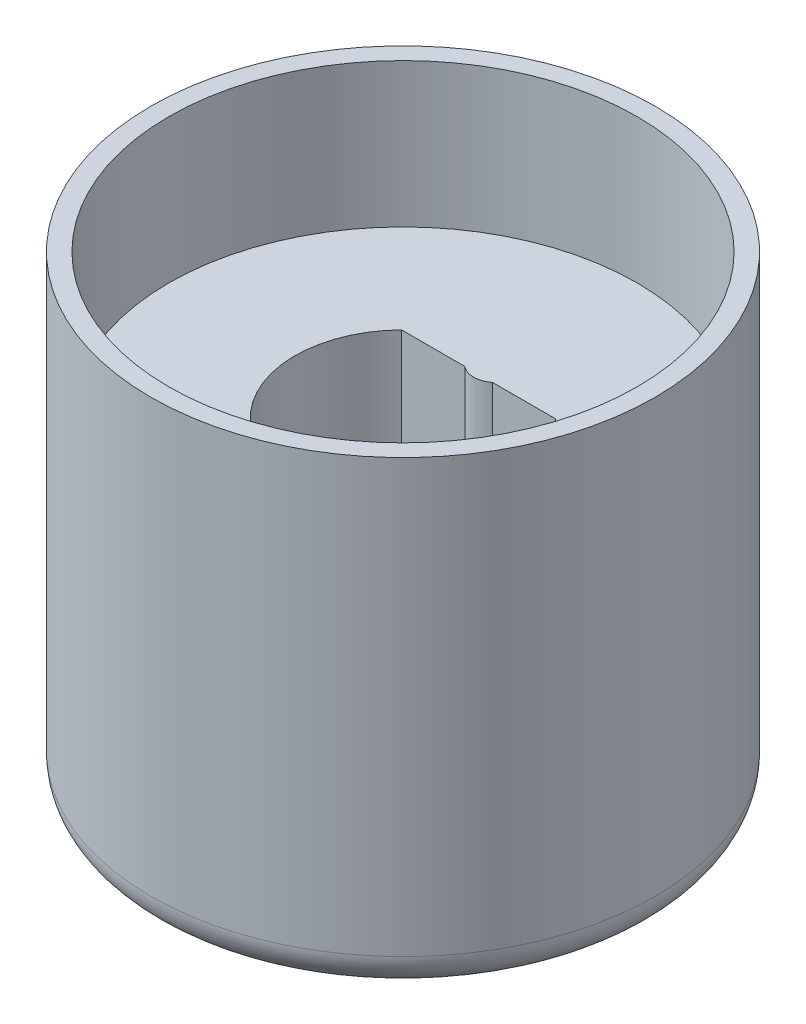
ISO-10303-21;
HEADER;
FILE_DESCRIPTION(('STEP AP214'),'2;1');
FILE_NAME('part.step','',(''),(''),'','','');
FILE_SCHEMA(('AUTOMOTIVE_DESIGN { 1 0 10303 214 1 1 1 1 }'));
ENDSEC;
DATA;
#1=APPLICATION_CONTEXT('core data for automotive mechanical design processes');
#2=APPLICATION_PROTOCOL_DEFINITION('international standard','automotive_design',2000,#1);
#3=PRODUCT_CONTEXT('',#1,'mechanical');
#4=PRODUCT('Part','Part','',(#3));
#5=PRODUCT_RELATED_PRODUCT_CATEGORY('part','',(#4));
#6=PRODUCT_DEFINITION_FORMATION('','',#4);
#7=PRODUCT_DEFINITION_CONTEXT('part definition',#1,'design');
#8=PRODUCT_DEFINITION('design','',#6,#7);
#9=PRODUCT_DEFINITION_SHAPE('','',#8);
#10=(LENGTH_UNIT() NAMED_UNIT(*) SI_UNIT(.MILLI.,.METRE.));
#11=(NAMED_UNIT(*) PLANE_ANGLE_UNIT() SI_UNIT($,.RADIAN.));
#12=(NAMED_UNIT(*) SI_UNIT($,.STERADIAN.) SOLID_ANGLE_UNIT());
#13=UNCERTAINTY_MEASURE_WITH_UNIT(LENGTH_MEASURE(1.E-05),#10,'distance_accuracy_value','');
#14=(GEOMETRIC_REPRESENTATION_CONTEXT(3) GLOBAL_UNCERTAINTY_ASSIGNED_CONTEXT((#13)) GLOBAL_UNIT_ASSIGNED_CONTEXT((#10,
#11,#12)) REPRESENTATION_CONTEXT('',''));
#15=CARTESIAN_POINT('',(0.,0.,0.));
#16=DIRECTION('',(0.,0.,1.));
#17=DIRECTION('',(1.,0.,0.));
#18=AXIS2_PLACEMENT_3D('',#15,#16,#17);
#19=CARTESIAN_POINT('',(0.,-1.,0.));
#20=DIRECTION('',(0.,-1.,0.));
#21=DIRECTION('',(0.,0.,-1.));
#22=AXIS2_PLACEMENT_3D('',#19,#20,#21);
#23=PLANE('',#22);
#24=CARTESIAN_POINT('',(0.,-1.,0.));
#25=DIRECTION('',(0.,-1.,0.));
#26=DIRECTION('',(0.,0.,1.));
#27=AXIS2_PLACEMENT_3D('',#24,#25,#26);
#28=CIRCLE('',#27,6.);
#29=CARTESIAN_POINT('',(0.,-1.,6.));
#30=VERTEX_POINT('',#29);
#31=EDGE_CURVE('E11',#30,#30,#28,.T.);
#32=ORIENTED_EDGE('',*,*,#31,.T.);
#33=EDGE_LOOP('',(#32));
#34=FACE_BOUND('',#33,.T.);
#35=ADVANCED_FACE('F17',(#34),#23,.T.);
#36=CARTESIAN_POINT('',(0.,0.,0.));
#37=DIRECTION('',(0.,-1.,0.));
#38=DIRECTION('',(0.,0.,1.));
#39=AXIS2_PLACEMENT_3D('',#36,#37,#38);
#40=TOROIDAL_SURFACE('',#39,6.,1.);
#41=CARTESIAN_POINT('',(0.,0.,0.));
#42=DIRECTION('',(0.,-1.,0.));
#43=DIRECTION('',(0.,0.,1.));
#44=AXIS2_PLACEMENT_3D('',#41,#42,#43);
#45=CIRCLE('',#44,7.);
#46=CARTESIAN_POINT('',(0.,0.,7.));
#47=VERTEX_POINT('',#46);
#48=EDGE_CURVE('E26',#47,#47,#45,.T.);
#49=ORIENTED_EDGE('',*,*,#48,.T.);
#50=EDGE_LOOP('',(#49));
#51=FACE_BOUND('',#50,.T.);
#52=ORIENTED_EDGE('',*,*,#31,.F.);
#53=EDGE_LOOP('',(#52));
#54=FACE_BOUND('',#53,.T.);
#55=ADVANCED_FACE('F19',(#51,#54),#40,.T.);
#56=CARTESIAN_POINT('',(0.,10.,0.));
#57=DIRECTION('',(0.,-1.,0.));
#58=DIRECTION('',(0.,0.,1.));
#59=AXIS2_PLACEMENT_3D('',#56,#57,#58);
#60=CYLINDRICAL_SURFACE('',#59,7.);
#61=CARTESIAN_POINT('',(0.,12.,0.));
#62=DIRECTION('',(0.,-1.,0.));
#63=DIRECTION('',(0.,0.,1.));
#64=AXIS2_PLACEMENT_3D('',#61,#62,#63);
#65=CIRCLE('',#64,7.);
#66=CARTESIAN_POINT('',(0.,12.,7.));
#67=VERTEX_POINT('',#66);
#68=EDGE_CURVE('E117',#67,#67,#65,.T.);
#69=ORIENTED_EDGE('',*,*,#68,.T.);
#70=EDGE_LOOP('',(#69));
#71=FACE_BOUND('',#70,.T.);
#72=ORIENTED_EDGE('',*,*,#48,.F.);
#73=EDGE_LOOP('',(#72));
#74=FACE_BOUND('',#73,.T.);
#75=ADVANCED_FACE('F143',(#71,#74),#60,.T.);
#76=CARTESIAN_POINT('',(-1.40086989389111E-13,1.45299799796709,0.));
#77=DIRECTION('',(0.,-1.,0.));
#78=DIRECTION('',(-1.,0.,0.));
#79=AXIS2_PLACEMENT_3D('',#76,#77,#78);
#80=PLANE('',#79);
#81=CARTESIAN_POINT('',(0.,1.45299799796709,0.));
#82=DIRECTION('',(0.,1.,0.));
#83=DIRECTION('',(-0.714142842854284,0.,-0.7));
#84=AXIS2_PLACEMENT_3D('',#81,#82,#83);
#85=CIRCLE('',#84,3.);
#86=CARTESIAN_POINT('',(-2.14242852856285,1.45299799796709,-2.1));
#87=VERTEX_POINT('',#86);
#88=CARTESIAN_POINT('',(2.14242852856285,1.45299799796709,-2.1));
#89=VERTEX_POINT('',#88);
#90=EDGE_CURVE('E93',#87,#89,#85,.T.);
#91=ORIENTED_EDGE('',*,*,#90,.T.);
#92=DIRECTION('',(-1.,0.,0.));
#93=VECTOR('',#92,1.);
#94=CARTESIAN_POINT('',(2.14242852856286,1.45299799796708,-2.1));
#95=LINE('',#94,#93);
#96=CARTESIAN_POINT('',(0.385264119871125,1.45299799796709,-2.1));
#97=VERTEX_POINT('',#96);
#98=EDGE_CURVE('E38',#89,#97,#95,.T.);
#99=ORIENTED_EDGE('',*,*,#98,.T.);
#100=CARTESIAN_POINT('',(0.,1.45299799796709,-2.57795522810966));
#101=DIRECTION('',(0.,-1.,0.));
#102=DIRECTION('',(0.627571173698928,0.,0.778559196170818));
#103=AXIS2_PLACEMENT_3D('',#100,#101,#102);
#104=CIRCLE('',#103,0.613897094094305);
#105=CARTESIAN_POINT('',(-0.385264119871124,1.45299799796709,-2.1));
#106=VERTEX_POINT('',#105);
#107=EDGE_CURVE('E125',#97,#106,#104,.T.);
#108=ORIENTED_EDGE('',*,*,#107,.T.);
#109=DIRECTION('',(-1.,0.,0.));
#110=VECTOR('',#109,1.);
#111=CARTESIAN_POINT('',(-0.385264119871124,1.45299799796709,-2.1));
#112=LINE('',#111,#110);
#113=EDGE_CURVE('E86',#106,#87,#112,.T.);
#114=ORIENTED_EDGE('',*,*,#113,.T.);
#115=EDGE_LOOP('',(#91,#99,#108,#114));
#116=FACE_BOUND('',#115,.T.);
#117=ADVANCED_FACE('F145',(#116),#80,.F.);
#118=CARTESIAN_POINT('',(0.,12.,0.));
#119=DIRECTION('',(0.,-1.,0.));
#120=DIRECTION('',(0.,0.,-1.));
#121=AXIS2_PLACEMENT_3D('',#118,#119,#120);
#122=PLANE('',#121);
#123=CARTESIAN_POINT('',(0.,12.,0.));
#124=DIRECTION('',(0.,-1.,0.));
#125=DIRECTION('',(-1.,0.,0.));
#126=AXIS2_PLACEMENT_3D('',#123,#124,#125);
#127=CIRCLE('',#126,6.5);
#128=CARTESIAN_POINT('',(-6.5,12.,0.));
#129=VERTEX_POINT('',#128);
#130=EDGE_CURVE('E100',#129,#129,#127,.T.);
#131=ORIENTED_EDGE('',*,*,#130,.T.);
#132=EDGE_LOOP('',(#131));
#133=FACE_BOUND('',#132,.T.);
#134=ORIENTED_EDGE('',*,*,#68,.F.);
#135=EDGE_LOOP('',(#134));
#136=FACE_BOUND('',#135,.T.);
#137=ADVANCED_FACE('F152',(#133,#136),#122,.F.);
#138=CARTESIAN_POINT('',(0.,8.,0.));
#139=DIRECTION('',(0.,1.,0.));
#140=DIRECTION('',(0.,0.,-1.));
#141=AXIS2_PLACEMENT_3D('',#138,#139,#140);
#142=PLANE('',#141);
#143=DIRECTION('',(-1.,0.,0.));
#144=VECTOR('',#143,1.);
#145=CARTESIAN_POINT('',(0.385264119871125,8.,-2.1));
#146=LINE('',#145,#144);
#147=CARTESIAN_POINT('',(2.14242852856285,8.,-2.1));
#148=VERTEX_POINT('',#147);
#149=CARTESIAN_POINT('',(0.385264119871125,8.,-2.1));
#150=VERTEX_POINT('',#149);
#151=EDGE_CURVE('E47',#148,#150,#146,.T.);
#152=ORIENTED_EDGE('',*,*,#151,.F.);
#153=CARTESIAN_POINT('',(0.,8.,0.));
#154=DIRECTION('',(0.,1.,0.));
#155=DIRECTION('',(-0.714142842854284,0.,-0.7));
#156=AXIS2_PLACEMENT_3D('',#153,#154,#155);
#157=CIRCLE('',#156,3.);
#158=CARTESIAN_POINT('',(-2.14242852856285,8.,-2.1));
#159=VERTEX_POINT('',#158);
#160=EDGE_CURVE('E92',#159,#148,#157,.T.);
#161=ORIENTED_EDGE('',*,*,#160,.F.);
#162=DIRECTION('',(-1.,0.,0.));
#163=VECTOR('',#162,1.);
#164=CARTESIAN_POINT('',(-2.14242852856286,8.,-2.1));
#165=LINE('',#164,#163);
#166=CARTESIAN_POINT('',(-0.385264119871124,8.,-2.1));
#167=VERTEX_POINT('',#166);
#168=EDGE_CURVE('E74',#167,#159,#165,.T.);
#169=ORIENTED_EDGE('',*,*,#168,.F.);
#170=CARTESIAN_POINT('',(0.,8.,-2.57795522810966));
#171=DIRECTION('',(0.,-1.,0.));
#172=DIRECTION('',(0.627571173698928,0.,0.778559196170818));
#173=AXIS2_PLACEMENT_3D('',#170,#171,#172);
#174=CIRCLE('',#173,0.613897094094305);
#175=EDGE_CURVE('E122',#150,#167,#174,.T.);
#176=ORIENTED_EDGE('',*,*,#175,.F.);
#177=EDGE_LOOP('',(#152,#161,#169,#176));
#178=FACE_BOUND('',#177,.T.);
#179=CARTESIAN_POINT('',(0.,8.,0.));
#180=DIRECTION('',(0.,1.,0.));
#181=DIRECTION('',(-1.,0.,0.));
#182=AXIS2_PLACEMENT_3D('',#179,#180,#181);
#183=CIRCLE('',#182,6.5);
#184=CARTESIAN_POINT('',(-6.5,8.,0.));
#185=VERTEX_POINT('',#184);
#186=EDGE_CURVE('E109',#185,#185,#183,.T.);
#187=ORIENTED_EDGE('',*,*,#186,.T.);
#188=EDGE_LOOP('',(#187));
#189=FACE_BOUND('',#188,.T.);
#190=ADVANCED_FACE('F96',(#178,#189),#142,.T.);
#191=CARTESIAN_POINT('',(2.14242852856286,0.,-2.1));
#192=DIRECTION('',(0.,0.,-1.));
#193=DIRECTION('',(-1.,0.,0.));
#194=AXIS2_PLACEMENT_3D('',#191,#192,#193);
#195=PLANE('',#194);
#196=ORIENTED_EDGE('',*,*,#151,.T.);
#197=DIRECTION('',(0.,1.,0.));
#198=VECTOR('',#197,1.);
#199=CARTESIAN_POINT('',(0.385264119871125,1.45299799796709,-2.1));
#200=LINE('',#199,#198);
#201=EDGE_CURVE('E128',#97,#150,#200,.T.);
#202=ORIENTED_EDGE('',*,*,#201,.F.);
#203=ORIENTED_EDGE('',*,*,#98,.F.);
#204=DIRECTION('',(0.,1.,0.));
#205=VECTOR('',#204,1.);
#206=CARTESIAN_POINT('',(2.14242852856285,1.45299799796709,-2.1));
#207=LINE('',#206,#205);
#208=EDGE_CURVE('E99',#89,#148,#207,.T.);
#209=ORIENTED_EDGE('',*,*,#208,.T.);
#210=EDGE_LOOP('',(#196,#202,#203,#209));
#211=FACE_BOUND('',#210,.T.);
#212=ADVANCED_FACE('F173',(#211),#195,.F.);
#213=CARTESIAN_POINT('',(0.,0.,-2.57795522810966));
#214=DIRECTION('',(0.,-1.,0.));
#215=DIRECTION('',(0.627571173698928,0.,0.778559196170818));
#216=AXIS2_PLACEMENT_3D('',#213,#214,#215);
#217=CYLINDRICAL_SURFACE('',#216,0.613897094094305);
#218=ORIENTED_EDGE('',*,*,#175,.T.);
#219=DIRECTION('',(0.,1.,0.));
#220=VECTOR('',#219,1.);
#221=CARTESIAN_POINT('',(-0.385264119871124,1.45299799796709,-2.1));
#222=LINE('',#221,#220);
#223=EDGE_CURVE('E81',#106,#167,#222,.T.);
#224=ORIENTED_EDGE('',*,*,#223,.F.);
#225=ORIENTED_EDGE('',*,*,#107,.F.);
#226=ORIENTED_EDGE('',*,*,#201,.T.);
#227=EDGE_LOOP('',(#218,#224,#225,#226));
#228=FACE_BOUND('',#227,.T.);
#229=ADVANCED_FACE('F172',(#228),#217,.T.);
#230=CARTESIAN_POINT('',(-0.385264119871124,0.,-2.1));
#231=DIRECTION('',(0.,0.,-1.));
#232=DIRECTION('',(-1.,0.,0.));
#233=AXIS2_PLACEMENT_3D('',#230,#231,#232);
#234=PLANE('',#233);
#235=ORIENTED_EDGE('',*,*,#168,.T.);
#236=DIRECTION('',(0.,1.,0.));
#237=VECTOR('',#236,1.);
#238=CARTESIAN_POINT('',(-2.14242852856285,1.45299799796709,-2.1));
#239=LINE('',#238,#237);
#240=EDGE_CURVE('E78',#87,#159,#239,.T.);
#241=ORIENTED_EDGE('',*,*,#240,.F.);
#242=ORIENTED_EDGE('',*,*,#113,.F.);
#243=ORIENTED_EDGE('',*,*,#223,.T.);
#244=EDGE_LOOP('',(#235,#241,#242,#243));
#245=FACE_BOUND('',#244,.T.);
#246=ADVANCED_FACE('F76',(#245),#234,.F.);
#247=CARTESIAN_POINT('',(0.,0.,0.));
#248=DIRECTION('',(0.,1.,0.));
#249=DIRECTION('',(-0.714142842854284,0.,-0.7));
#250=AXIS2_PLACEMENT_3D('',#247,#248,#249);
#251=CYLINDRICAL_SURFACE('',#250,3.);
#252=ORIENTED_EDGE('',*,*,#160,.T.);
#253=ORIENTED_EDGE('',*,*,#208,.F.);
#254=ORIENTED_EDGE('',*,*,#90,.F.);
#255=ORIENTED_EDGE('',*,*,#240,.T.);
#256=EDGE_LOOP('',(#252,#253,#254,#255));
#257=FACE_BOUND('',#256,.T.);
#258=ADVANCED_FACE('F90',(#257),#251,.F.);
#259=CARTESIAN_POINT('',(0.,8.5,0.));
#260=DIRECTION('',(0.,1.,0.));
#261=DIRECTION('',(-1.,0.,0.));
#262=AXIS2_PLACEMENT_3D('',#259,#260,#261);
#263=CYLINDRICAL_SURFACE('',#262,6.5);
#264=ORIENTED_EDGE('',*,*,#130,.F.);
#265=EDGE_LOOP('',(#264));
#266=FACE_BOUND('',#265,.T.);
#267=ORIENTED_EDGE('',*,*,#186,.F.);
#268=EDGE_LOOP('',(#267));
#269=FACE_BOUND('',#268,.T.);
#270=ADVANCED_FACE('F164',(#266,#269),#263,.F.);
#271=CLOSED_SHELL('',(#35,#55,#75,#117,#137,#190,#212,#229,#246,#258,#270));
#272=MANIFOLD_SOLID_BREP('B1',#271);
#273=ADVANCED_BREP_SHAPE_REPRESENTATION('',(#18,#272),#14);
#274=SHAPE_DEFINITION_REPRESENTATION(#9,#273);
ENDSEC;
END-ISO-10303-21;
